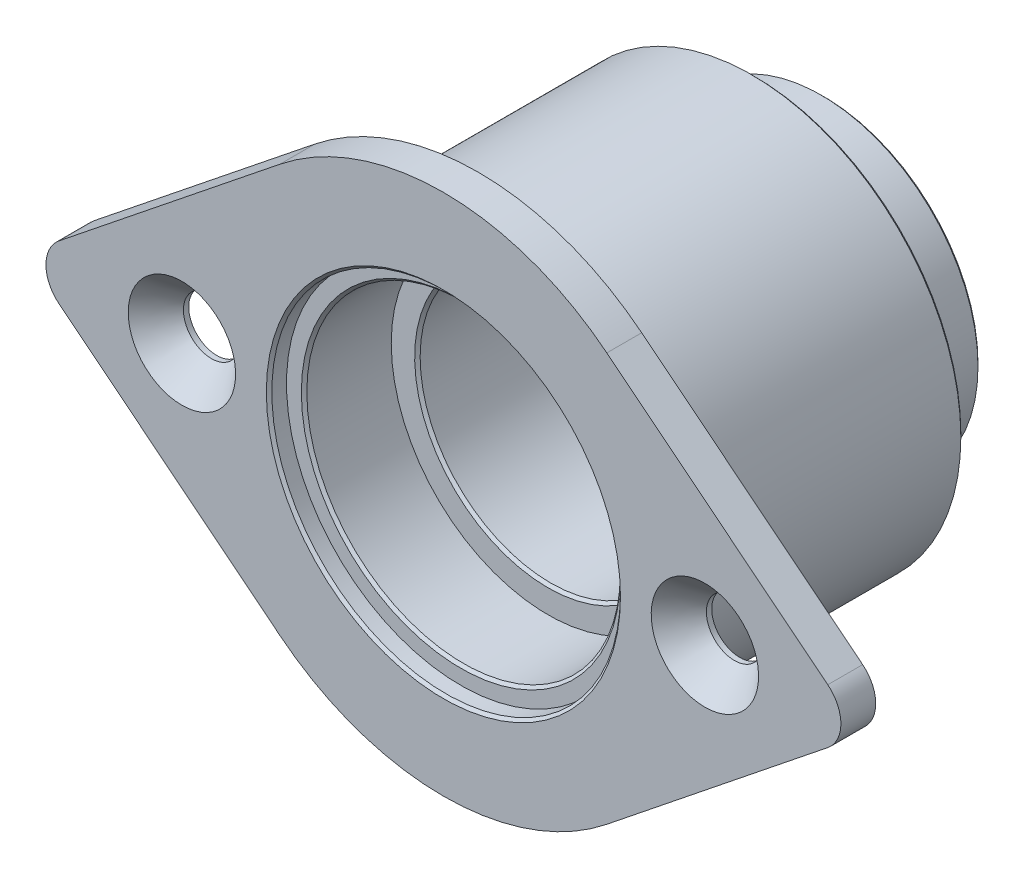
ISO-10303-21;
HEADER;
FILE_DESCRIPTION(('STEP AP214'),'2;1');
FILE_NAME('part.step','',(''),(''),'','','');
FILE_SCHEMA(('AUTOMOTIVE_DESIGN { 1 0 10303 214 1 1 1 1 }'));
ENDSEC;
DATA;
#1=APPLICATION_CONTEXT('core data for automotive mechanical design processes');
#2=APPLICATION_PROTOCOL_DEFINITION('international standard','automotive_design',2000,#1);
#3=PRODUCT_CONTEXT('',#1,'mechanical');
#4=PRODUCT('Part','Part','',(#3));
#5=PRODUCT_RELATED_PRODUCT_CATEGORY('part','',(#4));
#6=PRODUCT_DEFINITION_FORMATION('','',#4);
#7=PRODUCT_DEFINITION_CONTEXT('part definition',#1,'design');
#8=PRODUCT_DEFINITION('design','',#6,#7);
#9=PRODUCT_DEFINITION_SHAPE('','',#8);
#10=(LENGTH_UNIT() NAMED_UNIT(*) SI_UNIT(.MILLI.,.METRE.));
#11=(NAMED_UNIT(*) PLANE_ANGLE_UNIT() SI_UNIT($,.RADIAN.));
#12=(NAMED_UNIT(*) SI_UNIT($,.STERADIAN.) SOLID_ANGLE_UNIT());
#13=UNCERTAINTY_MEASURE_WITH_UNIT(LENGTH_MEASURE(1.E-05),#10,'distance_accuracy_value','');
#14=(GEOMETRIC_REPRESENTATION_CONTEXT(3) GLOBAL_UNCERTAINTY_ASSIGNED_CONTEXT((#13)) GLOBAL_UNIT_ASSIGNED_CONTEXT((#10,
#11,#12)) REPRESENTATION_CONTEXT('',''));
#15=CARTESIAN_POINT('',(0.,0.,0.));
#16=DIRECTION('',(0.,0.,1.));
#17=DIRECTION('',(1.,0.,0.));
#18=AXIS2_PLACEMENT_3D('',#15,#16,#17);
#19=CARTESIAN_POINT('',(0.,0.,-7.9375));
#20=DIRECTION('',(0.,0.,1.));
#21=DIRECTION('',(1.,0.,0.));
#22=AXIS2_PLACEMENT_3D('',#19,#20,#21);
#23=PLANE('',#22);
#24=CARTESIAN_POINT('',(0.,0.,-7.9375));
#25=DIRECTION('',(0.,0.,-1.));
#26=DIRECTION('',(-1.,0.,0.));
#27=AXIS2_PLACEMENT_3D('',#24,#25,#26);
#28=CIRCLE('',#27,14.2748);
#29=CARTESIAN_POINT('',(-14.2748,0.,-7.9375));
#30=VERTEX_POINT('',#29);
#31=EDGE_CURVE('E135',#30,#30,#28,.F.);
#32=ORIENTED_EDGE('',*,*,#31,.T.);
#33=EDGE_LOOP('',(#32));
#34=FACE_BOUND('',#33,.T.);
#35=CARTESIAN_POINT('',(0.,0.,-7.9375));
#36=DIRECTION('',(0.,0.,1.));
#37=DIRECTION('',(0.,-1.,0.));
#38=AXIS2_PLACEMENT_3D('',#35,#36,#37);
#39=CIRCLE('',#38,12.1435499999999);
#40=CARTESIAN_POINT('',(0.,-12.1435499999999,-7.9375));
#41=VERTEX_POINT('',#40);
#42=EDGE_CURVE('E19',#41,#41,#39,.F.);
#43=ORIENTED_EDGE('',*,*,#42,.T.);
#44=EDGE_LOOP('',(#43));
#45=FACE_BOUND('',#44,.T.);
#46=ADVANCED_FACE('F16',(#34,#45),#23,.T.);
#47=CARTESIAN_POINT('',(0.,0.,-7.9375));
#48=DIRECTION('',(0.,0.,1.));
#49=DIRECTION('',(0.,-1.,0.));
#50=AXIS2_PLACEMENT_3D('',#47,#48,#49);
#51=CONICAL_SURFACE('',#50,12.1435499999999,0.785398163397434);
#52=CARTESIAN_POINT('',(0.,0.,-8.18749999999995));
#53=DIRECTION('',(0.,0.,-1.));
#54=DIRECTION('',(-1.,0.,0.));
#55=AXIS2_PLACEMENT_3D('',#52,#53,#54);
#56=CIRCLE('',#55,11.89355);
#57=CARTESIAN_POINT('',(-11.89355,0.,-8.18749999999995));
#58=VERTEX_POINT('',#57);
#59=EDGE_CURVE('E133',#58,#58,#56,.T.);
#60=ORIENTED_EDGE('',*,*,#59,.T.);
#61=EDGE_LOOP('',(#60));
#62=FACE_BOUND('',#61,.T.);
#63=ORIENTED_EDGE('',*,*,#42,.F.);
#64=EDGE_LOOP('',(#63));
#65=FACE_BOUND('',#64,.T.);
#66=ADVANCED_FACE('F194',(#62,#65),#51,.F.);
#67=CARTESIAN_POINT('',(0.,0.,1.5875));
#68=DIRECTION('',(0.,0.,-1.));
#69=DIRECTION('',(-1.,0.,0.));
#70=AXIS2_PLACEMENT_3D('',#67,#68,#69);
#71=CYLINDRICAL_SURFACE('',#70,14.2748);
#72=CARTESIAN_POINT('',(0.,0.,-0.249999999999985));
#73=DIRECTION('',(0.,0.,1.));
#74=DIRECTION('',(1.,0.,0.));
#75=AXIS2_PLACEMENT_3D('',#72,#73,#74);
#76=CIRCLE('',#75,14.2748);
#77=CARTESIAN_POINT('',(14.2748,0.,-0.249999999999985));
#78=VERTEX_POINT('',#77);
#79=EDGE_CURVE('E130',#78,#78,#76,.T.);
#80=ORIENTED_EDGE('',*,*,#79,.T.);
#81=EDGE_LOOP('',(#80));
#82=FACE_BOUND('',#81,.T.);
#83=ORIENTED_EDGE('',*,*,#31,.F.);
#84=EDGE_LOOP('',(#83));
#85=FACE_BOUND('',#84,.T.);
#86=ADVANCED_FACE('F196',(#82,#85),#71,.F.);
#87=CARTESIAN_POINT('',(0.,0.,38.7877315203269));
#88=DIRECTION('',(0.,0.,-1.));
#89=DIRECTION('',(-1.,0.,0.));
#90=AXIS2_PLACEMENT_3D('',#87,#88,#89);
#91=CYLINDRICAL_SURFACE('',#90,11.89355);
#92=ORIENTED_EDGE('',*,*,#59,.F.);
#93=EDGE_LOOP('',(#92));
#94=FACE_BOUND('',#93,.T.);
#95=CARTESIAN_POINT('',(0.,0.,-32.8334999999999));
#96=DIRECTION('',(0.,0.,-1.));
#97=DIRECTION('',(-1.,0.,0.));
#98=AXIS2_PLACEMENT_3D('',#95,#96,#97);
#99=CIRCLE('',#98,11.89355);
#100=CARTESIAN_POINT('',(-11.89355,0.,-32.8334999999999));
#101=VERTEX_POINT('',#100);
#102=EDGE_CURVE('E126',#101,#101,#99,.T.);
#103=ORIENTED_EDGE('',*,*,#102,.T.);
#104=EDGE_LOOP('',(#103));
#105=FACE_BOUND('',#104,.T.);
#106=ADVANCED_FACE('F203',(#94,#105),#91,.F.);
#107=CARTESIAN_POINT('',(0.,0.,0.));
#108=DIRECTION('',(0.,0.,1.));
#109=DIRECTION('',(1.,0.,0.));
#110=AXIS2_PLACEMENT_3D('',#107,#108,#109);
#111=CONICAL_SURFACE('',#110,14.5248,0.785398163397459);
#112=ORIENTED_EDGE('',*,*,#79,.F.);
#113=EDGE_LOOP('',(#112));
#114=FACE_BOUND('',#113,.T.);
#115=CARTESIAN_POINT('',(0.,0.,0.));
#116=DIRECTION('',(0.,0.,1.));
#117=DIRECTION('',(1.,0.,0.));
#118=AXIS2_PLACEMENT_3D('',#115,#116,#117);
#119=CIRCLE('',#118,14.5248);
#120=CARTESIAN_POINT('',(14.5248,0.,0.));
#121=VERTEX_POINT('',#120);
#122=EDGE_CURVE('E129',#121,#121,#119,.F.);
#123=ORIENTED_EDGE('',*,*,#122,.F.);
#124=EDGE_LOOP('',(#123));
#125=FACE_BOUND('',#124,.T.);
#126=ADVANCED_FACE('F299',(#114,#125),#111,.F.);
#127=CARTESIAN_POINT('',(0.,0.,-33.0835));
#128=DIRECTION('',(0.,0.,-1.));
#129=DIRECTION('',(0.,1.,0.));
#130=AXIS2_PLACEMENT_3D('',#127,#128,#129);
#131=CONICAL_SURFACE('',#130,12.1435500000001,0.785398163397448);
#132=ORIENTED_EDGE('',*,*,#102,.F.);
#133=EDGE_LOOP('',(#132));
#134=FACE_BOUND('',#133,.T.);
#135=CARTESIAN_POINT('',(0.,0.,-33.0835));
#136=DIRECTION('',(0.,0.,-1.));
#137=DIRECTION('',(0.,1.,0.));
#138=AXIS2_PLACEMENT_3D('',#135,#136,#137);
#139=CIRCLE('',#138,12.1435500000001);
#140=CARTESIAN_POINT('',(0.,12.1435500000001,-33.0835));
#141=VERTEX_POINT('',#140);
#142=EDGE_CURVE('E183',#141,#141,#139,.F.);
#143=ORIENTED_EDGE('',*,*,#142,.F.);
#144=EDGE_LOOP('',(#143));
#145=FACE_BOUND('',#144,.T.);
#146=ADVANCED_FACE('F295',(#134,#145),#131,.F.);
#147=CARTESIAN_POINT('',(0.,0.,0.));
#148=DIRECTION('',(0.,0.,1.));
#149=DIRECTION('',(1.,0.,0.));
#150=AXIS2_PLACEMENT_3D('',#147,#148,#149);
#151=PLANE('',#150);
#152=CARTESIAN_POINT('',(0.,0.,0.));
#153=DIRECTION('',(0.,0.,1.));
#154=DIRECTION('',(1.,0.,0.));
#155=AXIS2_PLACEMENT_3D('',#152,#153,#154);
#156=CIRCLE('',#155,15.875);
#157=CARTESIAN_POINT('',(15.875,0.,0.));
#158=VERTEX_POINT('',#157);
#159=EDGE_CURVE('E180',#158,#158,#156,.T.);
#160=ORIENTED_EDGE('',*,*,#159,.T.);
#161=EDGE_LOOP('',(#160));
#162=FACE_BOUND('',#161,.T.);
#163=ORIENTED_EDGE('',*,*,#122,.T.);
#164=EDGE_LOOP('',(#163));
#165=FACE_BOUND('',#164,.T.);
#166=ADVANCED_FACE('F291',(#162,#165),#151,.T.);
#167=CARTESIAN_POINT('',(0.,0.,-33.0835));
#168=DIRECTION('',(0.,0.,-1.));
#169=DIRECTION('',(-1.,0.,0.));
#170=AXIS2_PLACEMENT_3D('',#167,#168,#169);
#171=PLANE('',#170);
#172=ORIENTED_EDGE('',*,*,#142,.T.);
#173=EDGE_LOOP('',(#172));
#174=FACE_BOUND('',#173,.T.);
#175=CARTESIAN_POINT('',(0.,0.,-33.0835));
#176=DIRECTION('',(0.,0.,1.));
#177=DIRECTION('',(1.,0.,0.));
#178=AXIS2_PLACEMENT_3D('',#175,#176,#177);
#179=CIRCLE('',#178,14.0121);
#180=CARTESIAN_POINT('',(14.0121,0.,-33.0835));
#181=VERTEX_POINT('',#180);
#182=EDGE_CURVE('E125',#181,#181,#179,.T.);
#183=ORIENTED_EDGE('',*,*,#182,.F.);
#184=EDGE_LOOP('',(#183));
#185=FACE_BOUND('',#184,.T.);
#186=ADVANCED_FACE('F287',(#174,#185),#171,.T.);
#187=CARTESIAN_POINT('',(0.,0.,0.));
#188=DIRECTION('',(0.,0.,1.));
#189=DIRECTION('',(1.,0.,0.));
#190=AXIS2_PLACEMENT_3D('',#187,#188,#189);
#191=CYLINDRICAL_SURFACE('',#190,15.875);
#192=ORIENTED_EDGE('',*,*,#159,.F.);
#193=EDGE_LOOP('',(#192));
#194=FACE_BOUND('',#193,.T.);
#195=CARTESIAN_POINT('',(0.,0.,1.3375));
#196=DIRECTION('',(0.,0.,1.));
#197=DIRECTION('',(1.,0.,0.));
#198=AXIS2_PLACEMENT_3D('',#195,#196,#197);
#199=CIRCLE('',#198,15.875);
#200=CARTESIAN_POINT('',(15.875,0.,1.3375));
#201=VERTEX_POINT('',#200);
#202=EDGE_CURVE('E122',#201,#201,#199,.T.);
#203=ORIENTED_EDGE('',*,*,#202,.T.);
#204=EDGE_LOOP('',(#203));
#205=FACE_BOUND('',#204,.T.);
#206=ADVANCED_FACE('F283',(#194,#205),#191,.F.);
#207=CARTESIAN_POINT('',(0.,0.,-32.8335));
#208=DIRECTION('',(0.,0.,1.));
#209=DIRECTION('',(1.,0.,0.));
#210=AXIS2_PLACEMENT_3D('',#207,#208,#209);
#211=CONICAL_SURFACE('',#210,14.2621,0.785398163397424);
#212=CARTESIAN_POINT('',(0.,0.,-32.8335));
#213=DIRECTION('',(0.,0.,-1.));
#214=DIRECTION('',(-1.,0.,0.));
#215=AXIS2_PLACEMENT_3D('',#212,#213,#214);
#216=CIRCLE('',#215,14.2621);
#217=CARTESIAN_POINT('',(-14.2621,0.,-32.8335));
#218=VERTEX_POINT('',#217);
#219=EDGE_CURVE('E118',#218,#218,#216,.F.);
#220=ORIENTED_EDGE('',*,*,#219,.F.);
#221=EDGE_LOOP('',(#220));
#222=FACE_BOUND('',#221,.T.);
#223=ORIENTED_EDGE('',*,*,#182,.T.);
#224=EDGE_LOOP('',(#223));
#225=FACE_BOUND('',#224,.T.);
#226=ADVANCED_FACE('F279',(#222,#225),#211,.T.);
#227=CARTESIAN_POINT('',(0.,0.,1.5875));
#228=DIRECTION('',(0.,0.,1.));
#229=DIRECTION('',(1.,0.,0.));
#230=AXIS2_PLACEMENT_3D('',#227,#228,#229);
#231=CONICAL_SURFACE('',#230,16.125,0.785398163397476);
#232=ORIENTED_EDGE('',*,*,#202,.F.);
#233=EDGE_LOOP('',(#232));
#234=FACE_BOUND('',#233,.T.);
#235=CARTESIAN_POINT('',(0.,0.,1.5875));
#236=DIRECTION('',(0.,0.,1.));
#237=DIRECTION('',(1.,0.,0.));
#238=AXIS2_PLACEMENT_3D('',#235,#236,#237);
#239=CIRCLE('',#238,16.125);
#240=CARTESIAN_POINT('',(16.125,0.,1.5875));
#241=VERTEX_POINT('',#240);
#242=EDGE_CURVE('E121',#241,#241,#239,.F.);
#243=ORIENTED_EDGE('',*,*,#242,.F.);
#244=EDGE_LOOP('',(#243));
#245=FACE_BOUND('',#244,.T.);
#246=ADVANCED_FACE('F275',(#234,#245),#231,.F.);
#247=CARTESIAN_POINT('',(0.,0.,27.1480367264149));
#248=DIRECTION('',(0.,0.,-1.));
#249=DIRECTION('',(-1.,0.,0.));
#250=AXIS2_PLACEMENT_3D('',#247,#248,#249);
#251=CYLINDRICAL_SURFACE('',#250,14.2621);
#252=ORIENTED_EDGE('',*,*,#219,.T.);
#253=EDGE_LOOP('',(#252));
#254=FACE_BOUND('',#253,.T.);
#255=CARTESIAN_POINT('',(0.,0.,-26.7335));
#256=DIRECTION('',(0.,0.,-1.));
#257=DIRECTION('',(-1.,0.,0.));
#258=AXIS2_PLACEMENT_3D('',#255,#256,#257);
#259=CIRCLE('',#258,14.2621);
#260=CARTESIAN_POINT('',(-14.2621,0.,-26.7335));
#261=VERTEX_POINT('',#260);
#262=EDGE_CURVE('E117',#261,#261,#259,.F.);
#263=ORIENTED_EDGE('',*,*,#262,.F.);
#264=EDGE_LOOP('',(#263));
#265=FACE_BOUND('',#264,.T.);
#266=ADVANCED_FACE('F271',(#254,#265),#251,.T.);
#267=CARTESIAN_POINT('',(-23.8125,0.,1.58749999997099));
#268=DIRECTION('',(0.,0.,1.));
#269=DIRECTION('',(0.,-1.,0.));
#270=AXIS2_PLACEMENT_3D('',#267,#268,#269);
#271=CONICAL_SURFACE('',#270,4.88949999997067,0.71558499333661);
#272=CARTESIAN_POINT('',(-23.8125,0.,-1.10068089399406));
#273=DIRECTION('',(0.,0.,1.));
#274=DIRECTION('',(1.,0.,0.));
#275=AXIS2_PLACEMENT_3D('',#272,#273,#274);
#276=CIRCLE('',#275,2.5527);
#277=CARTESIAN_POINT('',(-21.2598,0.,-1.10068089399406));
#278=VERTEX_POINT('',#277);
#279=EDGE_CURVE('E114',#278,#278,#276,.F.);
#280=ORIENTED_EDGE('',*,*,#279,.T.);
#281=EDGE_LOOP('',(#280));
#282=FACE_BOUND('',#281,.T.);
#283=CARTESIAN_POINT('',(-23.8125,0.,1.58749999997099));
#284=DIRECTION('',(0.,0.,1.));
#285=DIRECTION('',(0.,-1.,0.));
#286=AXIS2_PLACEMENT_3D('',#283,#284,#285);
#287=CIRCLE('',#286,4.88949999997067);
#288=CARTESIAN_POINT('',(-23.8125,-4.88949999997067,1.58749999997099));
#289=VERTEX_POINT('',#288);
#290=EDGE_CURVE('E173',#289,#289,#287,.F.);
#291=ORIENTED_EDGE('',*,*,#290,.F.);
#292=EDGE_LOOP('',(#291));
#293=FACE_BOUND('',#292,.T.);
#294=ADVANCED_FACE('F267',(#282,#293),#271,.F.);
#295=CARTESIAN_POINT('',(23.8125,0.,1.58749999997099));
#296=DIRECTION('',(0.,0.,1.));
#297=DIRECTION('',(0.,-1.,0.));
#298=AXIS2_PLACEMENT_3D('',#295,#296,#297);
#299=CONICAL_SURFACE('',#298,4.88949999995293,0.71558499333661);
#300=CARTESIAN_POINT('',(23.8125,0.,-1.10068089399406));
#301=DIRECTION('',(0.,0.,1.));
#302=DIRECTION('',(1.,0.,0.));
#303=AXIS2_PLACEMENT_3D('',#300,#301,#302);
#304=CIRCLE('',#303,2.5527);
#305=CARTESIAN_POINT('',(26.3652,0.,-1.10068089399406));
#306=VERTEX_POINT('',#305);
#307=EDGE_CURVE('E92',#306,#306,#304,.F.);
#308=ORIENTED_EDGE('',*,*,#307,.T.);
#309=EDGE_LOOP('',(#308));
#310=FACE_BOUND('',#309,.T.);
#311=CARTESIAN_POINT('',(23.8125,0.,1.58749999997099));
#312=DIRECTION('',(0.,0.,1.));
#313=DIRECTION('',(0.,-1.,0.));
#314=AXIS2_PLACEMENT_3D('',#311,#312,#313);
#315=CIRCLE('',#314,4.88949999995293);
#316=CARTESIAN_POINT('',(23.8125,-4.88949999995292,1.58749999997099));
#317=VERTEX_POINT('',#316);
#318=EDGE_CURVE('E170',#317,#317,#315,.F.);
#319=ORIENTED_EDGE('',*,*,#318,.F.);
#320=EDGE_LOOP('',(#319));
#321=FACE_BOUND('',#320,.T.);
#322=ADVANCED_FACE('F264',(#310,#321),#299,.F.);
#323=CARTESIAN_POINT('',(0.,0.,1.5875));
#324=DIRECTION('',(0.,0.,1.));
#325=DIRECTION('',(1.,0.,0.));
#326=AXIS2_PLACEMENT_3D('',#323,#324,#325);
#327=PLANE('',#326);
#328=DIRECTION('',(-0.7806247497998,0.625,0.));
#329=VECTOR('',#328,1.);
#330=CARTESIAN_POINT('',(-14.8828125,-18.5886268546077,1.5875));
#331=LINE('',#330,#329);
#332=CARTESIAN_POINT('',(-35.004375,-2.47848358061436,1.5875));
#333=VERTEX_POINT('',#332);
#334=CARTESIAN_POINT('',(-14.8828125,-18.5886268546077,1.5875));
#335=VERTEX_POINT('',#334);
#336=EDGE_CURVE('E110',#333,#335,#331,.F.);
#337=ORIENTED_EDGE('',*,*,#336,.T.);
#338=CARTESIAN_POINT('',(0.,0.,1.5875));
#339=DIRECTION('',(0.,0.,-1.));
#340=DIRECTION('',(-1.,0.,0.));
#341=AXIS2_PLACEMENT_3D('',#338,#339,#340);
#342=CIRCLE('',#341,23.8125);
#343=CARTESIAN_POINT('',(14.8828125,-18.5886268546077,1.5875));
#344=VERTEX_POINT('',#343);
#345=EDGE_CURVE('E162',#344,#335,#342,.T.);
#346=ORIENTED_EDGE('',*,*,#345,.F.);
#347=DIRECTION('',(0.7806247497998,0.625,0.));
#348=VECTOR('',#347,1.);
#349=CARTESIAN_POINT('',(14.8828125,-18.5886268546077,1.5875));
#350=LINE('',#349,#348);
#351=CARTESIAN_POINT('',(35.004375,-2.47848358061437,1.5875));
#352=VERTEX_POINT('',#351);
#353=EDGE_CURVE('E552',#352,#344,#350,.F.);
#354=ORIENTED_EDGE('',*,*,#353,.F.);
#355=CARTESIAN_POINT('',(33.02,0.,1.5875));
#356=DIRECTION('',(0.,0.,-1.));
#357=DIRECTION('',(-1.,0.,0.));
#358=AXIS2_PLACEMENT_3D('',#355,#356,#357);
#359=CIRCLE('',#358,3.175);
#360=CARTESIAN_POINT('',(35.004375,2.47848358061436,1.5875));
#361=VERTEX_POINT('',#360);
#362=EDGE_CURVE('E157',#361,#352,#359,.T.);
#363=ORIENTED_EDGE('',*,*,#362,.F.);
#364=DIRECTION('',(-0.7806247497998,0.625,0.));
#365=VECTOR('',#364,1.);
#366=CARTESIAN_POINT('',(14.8828125,18.5886268546077,1.5875));
#367=LINE('',#366,#365);
#368=CARTESIAN_POINT('',(14.8828125,18.5886268546077,1.5875));
#369=VERTEX_POINT('',#368);
#370=EDGE_CURVE('E88',#369,#361,#367,.F.);
#371=ORIENTED_EDGE('',*,*,#370,.F.);
#372=CARTESIAN_POINT('',(0.,0.,1.5875));
#373=DIRECTION('',(0.,0.,-1.));
#374=DIRECTION('',(-1.,0.,0.));
#375=AXIS2_PLACEMENT_3D('',#372,#373,#374);
#376=CIRCLE('',#375,23.8125);
#377=CARTESIAN_POINT('',(-14.8828125,18.5886268546077,1.5875));
#378=VERTEX_POINT('',#377);
#379=EDGE_CURVE('E80',#378,#369,#376,.T.);
#380=ORIENTED_EDGE('',*,*,#379,.F.);
#381=DIRECTION('',(0.7806247497998,0.625,0.));
#382=VECTOR('',#381,1.);
#383=CARTESIAN_POINT('',(-14.8828125,18.5886268546077,1.5875));
#384=LINE('',#383,#382);
#385=CARTESIAN_POINT('',(-35.004375,2.47848358061436,1.5875));
#386=VERTEX_POINT('',#385);
#387=EDGE_CURVE('E85',#378,#386,#384,.F.);
#388=ORIENTED_EDGE('',*,*,#387,.T.);
#389=CARTESIAN_POINT('',(-33.02,0.,1.5875));
#390=DIRECTION('',(0.,0.,-1.));
#391=DIRECTION('',(-1.,0.,0.));
#392=AXIS2_PLACEMENT_3D('',#389,#390,#391);
#393=CIRCLE('',#392,3.175);
#394=EDGE_CURVE('E106',#333,#386,#393,.T.);
#395=ORIENTED_EDGE('',*,*,#394,.F.);
#396=EDGE_LOOP('',(#337,#346,#354,#363,#371,#380,#388,#395));
#397=FACE_BOUND('',#396,.T.);
#398=ORIENTED_EDGE('',*,*,#318,.T.);
#399=EDGE_LOOP('',(#398));
#400=FACE_BOUND('',#399,.T.);
#401=ORIENTED_EDGE('',*,*,#290,.T.);
#402=EDGE_LOOP('',(#401));
#403=FACE_BOUND('',#402,.T.);
#404=ORIENTED_EDGE('',*,*,#242,.T.);
#405=EDGE_LOOP('',(#404));
#406=FACE_BOUND('',#405,.T.);
#407=ADVANCED_FACE('F82',(#397,#400,#403,#406),#327,.T.);
#408=CARTESIAN_POINT('',(0.,0.,-26.7335));
#409=DIRECTION('',(0.,0.,-1.));
#410=DIRECTION('',(-1.,0.,0.));
#411=AXIS2_PLACEMENT_3D('',#408,#409,#410);
#412=PLANE('',#411);
#413=ORIENTED_EDGE('',*,*,#262,.T.);
#414=EDGE_LOOP('',(#413));
#415=FACE_BOUND('',#414,.T.);
#416=CARTESIAN_POINT('',(0.,0.,-26.7335));
#417=DIRECTION('',(0.,0.,1.));
#418=DIRECTION('',(1.,0.,0.));
#419=AXIS2_PLACEMENT_3D('',#416,#417,#418);
#420=CIRCLE('',#419,18.8);
#421=CARTESIAN_POINT('',(18.8,0.,-26.7335));
#422=VERTEX_POINT('',#421);
#423=EDGE_CURVE('E153',#422,#422,#420,.T.);
#424=ORIENTED_EDGE('',*,*,#423,.F.);
#425=EDGE_LOOP('',(#424));
#426=FACE_BOUND('',#425,.T.);
#427=ADVANCED_FACE('F257',(#415,#426),#412,.T.);
#428=CARTESIAN_POINT('',(-23.8125,0.,1.5875));
#429=DIRECTION('',(0.,0.,1.));
#430=DIRECTION('',(1.,0.,0.));
#431=AXIS2_PLACEMENT_3D('',#428,#429,#430);
#432=CYLINDRICAL_SURFACE('',#431,2.5527);
#433=CARTESIAN_POINT('',(-23.8125,0.,-1.5875));
#434=DIRECTION('',(0.,0.,1.));
#435=DIRECTION('',(1.,0.,0.));
#436=AXIS2_PLACEMENT_3D('',#433,#434,#435);
#437=CIRCLE('',#436,2.5527);
#438=CARTESIAN_POINT('',(-21.2598,0.,-1.5875));
#439=VERTEX_POINT('',#438);
#440=EDGE_CURVE('E150',#439,#439,#437,.F.);
#441=ORIENTED_EDGE('',*,*,#440,.T.);
#442=EDGE_LOOP('',(#441));
#443=FACE_BOUND('',#442,.T.);
#444=ORIENTED_EDGE('',*,*,#279,.F.);
#445=EDGE_LOOP('',(#444));
#446=FACE_BOUND('',#445,.T.);
#447=ADVANCED_FACE('F253',(#443,#446),#432,.F.);
#448=CARTESIAN_POINT('',(23.8125,0.,1.5875));
#449=DIRECTION('',(0.,0.,1.));
#450=DIRECTION('',(1.,0.,0.));
#451=AXIS2_PLACEMENT_3D('',#448,#449,#450);
#452=CYLINDRICAL_SURFACE('',#451,2.5527);
#453=CARTESIAN_POINT('',(23.8125,0.,-1.5875));
#454=DIRECTION('',(0.,0.,1.));
#455=DIRECTION('',(1.,0.,0.));
#456=AXIS2_PLACEMENT_3D('',#453,#454,#455);
#457=CIRCLE('',#456,2.5527);
#458=CARTESIAN_POINT('',(26.3652,0.,-1.5875));
#459=VERTEX_POINT('',#458);
#460=EDGE_CURVE('E147',#459,#459,#457,.F.);
#461=ORIENTED_EDGE('',*,*,#460,.T.);
#462=EDGE_LOOP('',(#461));
#463=FACE_BOUND('',#462,.T.);
#464=ORIENTED_EDGE('',*,*,#307,.F.);
#465=EDGE_LOOP('',(#464));
#466=FACE_BOUND('',#465,.T.);
#467=ADVANCED_FACE('F250',(#463,#466),#452,.F.);
#468=CARTESIAN_POINT('',(0.,0.,1.5875));
#469=DIRECTION('',(0.,0.,-1.));
#470=DIRECTION('',(-1.,0.,0.));
#471=AXIS2_PLACEMENT_3D('',#468,#469,#470);
#472=CYLINDRICAL_SURFACE('',#471,23.8125);
#473=ORIENTED_EDGE('',*,*,#379,.T.);
#474=DIRECTION('',(0.,0.,1.));
#475=VECTOR('',#474,1.);
#476=CARTESIAN_POINT('',(14.8828125,18.5886268546077,1.5875));
#477=LINE('',#476,#475);
#478=CARTESIAN_POINT('',(14.8828125,18.5886268546077,-1.5875));
#479=VERTEX_POINT('',#478);
#480=EDGE_CURVE('E156',#479,#369,#477,.T.);
#481=ORIENTED_EDGE('',*,*,#480,.F.);
#482=CARTESIAN_POINT('',(0.,0.,-1.5875));
#483=DIRECTION('',(0.,0.,-1.));
#484=DIRECTION('',(-1.,0.,0.));
#485=AXIS2_PLACEMENT_3D('',#482,#483,#484);
#486=CIRCLE('',#485,23.8125);
#487=CARTESIAN_POINT('',(-14.8828125,18.5886268546077,-1.5875));
#488=VERTEX_POINT('',#487);
#489=EDGE_CURVE('E97',#479,#488,#486,.F.);
#490=ORIENTED_EDGE('',*,*,#489,.T.);
#491=DIRECTION('',(0.,0.,1.));
#492=VECTOR('',#491,1.);
#493=CARTESIAN_POINT('',(-14.8828125,18.5886268546077,1.5875));
#494=LINE('',#493,#492);
#495=EDGE_CURVE('E91',#488,#378,#494,.T.);
#496=ORIENTED_EDGE('',*,*,#495,.T.);
#497=EDGE_LOOP('',(#473,#481,#490,#496));
#498=FACE_BOUND('',#497,.T.);
#499=ADVANCED_FACE('F95',(#498),#472,.T.);
#500=CARTESIAN_POINT('',(-14.8828125,18.5886268546077,1.5875));
#501=DIRECTION('',(0.625,-0.7806247497998,0.));
#502=DIRECTION('',(0.7806247497998,0.625,0.));
#503=AXIS2_PLACEMENT_3D('',#500,#501,#502);
#504=PLANE('',#503);
#505=DIRECTION('',(0.,0.,-1.));
#506=VECTOR('',#505,1.);
#507=CARTESIAN_POINT('',(-35.004375,2.47848358061435,1.5875));
#508=LINE('',#507,#506);
#509=CARTESIAN_POINT('',(-35.004375,2.47848358061436,-1.5875));
#510=VERTEX_POINT('',#509);
#511=EDGE_CURVE('E104',#386,#510,#508,.T.);
#512=ORIENTED_EDGE('',*,*,#511,.F.);
#513=ORIENTED_EDGE('',*,*,#387,.F.);
#514=ORIENTED_EDGE('',*,*,#495,.F.);
#515=DIRECTION('',(-0.7806247497998,-0.625,0.));
#516=VECTOR('',#515,1.);
#517=CARTESIAN_POINT('',(-14.8828125,18.5886268546077,-1.5875));
#518=LINE('',#517,#516);
#519=EDGE_CURVE('E145',#488,#510,#518,.T.);
#520=ORIENTED_EDGE('',*,*,#519,.T.);
#521=EDGE_LOOP('',(#512,#513,#514,#520));
#522=FACE_BOUND('',#521,.T.);
#523=ADVANCED_FACE('F102',(#522),#504,.F.);
#524=CARTESIAN_POINT('',(-33.02,0.,1.5875));
#525=DIRECTION('',(0.,0.,-1.));
#526=DIRECTION('',(-1.,0.,0.));
#527=AXIS2_PLACEMENT_3D('',#524,#525,#526);
#528=CYLINDRICAL_SURFACE('',#527,3.175);
#529=CARTESIAN_POINT('',(-33.02,0.,-1.5875));
#530=DIRECTION('',(0.,0.,-1.));
#531=DIRECTION('',(-1.,0.,0.));
#532=AXIS2_PLACEMENT_3D('',#529,#530,#531);
#533=CIRCLE('',#532,3.175);
#534=CARTESIAN_POINT('',(-35.004375,-2.47848358061437,-1.5875));
#535=VERTEX_POINT('',#534);
#536=EDGE_CURVE('E143',#510,#535,#533,.F.);
#537=ORIENTED_EDGE('',*,*,#536,.T.);
#538=DIRECTION('',(0.,0.,1.));
#539=VECTOR('',#538,1.);
#540=CARTESIAN_POINT('',(-35.004375,-2.47848358061437,1.5875));
#541=LINE('',#540,#539);
#542=EDGE_CURVE('E166',#535,#333,#541,.T.);
#543=ORIENTED_EDGE('',*,*,#542,.T.);
#544=ORIENTED_EDGE('',*,*,#394,.T.);
#545=ORIENTED_EDGE('',*,*,#511,.T.);
#546=EDGE_LOOP('',(#537,#543,#544,#545));
#547=FACE_BOUND('',#546,.T.);
#548=ADVANCED_FACE('F241',(#547),#528,.T.);
#549=CARTESIAN_POINT('',(-14.8828125,-18.5886268546077,1.5875));
#550=DIRECTION('',(0.625,0.7806247497998,0.));
#551=DIRECTION('',(-0.7806247497998,0.625,0.));
#552=AXIS2_PLACEMENT_3D('',#549,#550,#551);
#553=PLANE('',#552);
#554=ORIENTED_EDGE('',*,*,#542,.F.);
#555=DIRECTION('',(0.7806247497998,-0.625,0.));
#556=VECTOR('',#555,1.);
#557=CARTESIAN_POINT('',(-35.004375,-2.47848358061437,-1.5875));
#558=LINE('',#557,#556);
#559=CARTESIAN_POINT('',(-14.8828125,-18.5886268546077,-1.5875));
#560=VERTEX_POINT('',#559);
#561=EDGE_CURVE('E142',#535,#560,#558,.T.);
#562=ORIENTED_EDGE('',*,*,#561,.T.);
#563=DIRECTION('',(0.,0.,-1.));
#564=VECTOR('',#563,1.);
#565=CARTESIAN_POINT('',(-14.8828125,-18.5886268546077,1.5875));
#566=LINE('',#565,#564);
#567=EDGE_CURVE('E165',#335,#560,#566,.T.);
#568=ORIENTED_EDGE('',*,*,#567,.F.);
#569=ORIENTED_EDGE('',*,*,#336,.F.);
#570=EDGE_LOOP('',(#554,#562,#568,#569));
#571=FACE_BOUND('',#570,.T.);
#572=ADVANCED_FACE('F237',(#571),#553,.F.);
#573=CARTESIAN_POINT('',(0.,0.,1.5875));
#574=DIRECTION('',(0.,0.,-1.));
#575=DIRECTION('',(-1.,0.,0.));
#576=AXIS2_PLACEMENT_3D('',#573,#574,#575);
#577=CYLINDRICAL_SURFACE('',#576,23.8125);
#578=ORIENTED_EDGE('',*,*,#345,.T.);
#579=ORIENTED_EDGE('',*,*,#567,.T.);
#580=CARTESIAN_POINT('',(0.,0.,-1.5875));
#581=DIRECTION('',(0.,0.,-1.));
#582=DIRECTION('',(-1.,0.,0.));
#583=AXIS2_PLACEMENT_3D('',#580,#581,#582);
#584=CIRCLE('',#583,23.8125);
#585=CARTESIAN_POINT('',(14.8828125,-18.5886268546077,-1.5875));
#586=VERTEX_POINT('',#585);
#587=EDGE_CURVE('E140',#560,#586,#584,.F.);
#588=ORIENTED_EDGE('',*,*,#587,.T.);
#589=DIRECTION('',(0.,0.,1.));
#590=VECTOR('',#589,1.);
#591=CARTESIAN_POINT('',(14.8828125,-18.5886268546077,1.5875));
#592=LINE('',#591,#590);
#593=EDGE_CURVE('E161',#344,#586,#592,.F.);
#594=ORIENTED_EDGE('',*,*,#593,.F.);
#595=EDGE_LOOP('',(#578,#579,#588,#594));
#596=FACE_BOUND('',#595,.T.);
#597=ADVANCED_FACE('F233',(#596),#577,.T.);
#598=CARTESIAN_POINT('',(14.8828125,-18.5886268546077,1.5875));
#599=DIRECTION('',(0.625,-0.7806247497998,0.));
#600=DIRECTION('',(0.7806247497998,0.625,0.));
#601=AXIS2_PLACEMENT_3D('',#598,#599,#600);
#602=PLANE('',#601);
#603=ORIENTED_EDGE('',*,*,#353,.T.);
#604=ORIENTED_EDGE('',*,*,#593,.T.);
#605=DIRECTION('',(0.7806247497998,0.625,0.));
#606=VECTOR('',#605,1.);
#607=CARTESIAN_POINT('',(14.8828125,-18.5886268546077,-1.5875));
#608=LINE('',#607,#606);
#609=CARTESIAN_POINT('',(35.004375,-2.47848358061437,-1.5875));
#610=VERTEX_POINT('',#609);
#611=EDGE_CURVE('E139',#586,#610,#608,.T.);
#612=ORIENTED_EDGE('',*,*,#611,.T.);
#613=DIRECTION('',(0.,0.,-1.));
#614=VECTOR('',#613,1.);
#615=CARTESIAN_POINT('',(35.004375,-2.47848358061437,1.5875));
#616=LINE('',#615,#614);
#617=EDGE_CURVE('E160',#352,#610,#616,.T.);
#618=ORIENTED_EDGE('',*,*,#617,.F.);
#619=EDGE_LOOP('',(#603,#604,#612,#618));
#620=FACE_BOUND('',#619,.T.);
#621=ADVANCED_FACE('F230',(#620),#602,.T.);
#622=CARTESIAN_POINT('',(33.02,0.,1.5875));
#623=DIRECTION('',(0.,0.,-1.));
#624=DIRECTION('',(-1.,0.,0.));
#625=AXIS2_PLACEMENT_3D('',#622,#623,#624);
#626=CYLINDRICAL_SURFACE('',#625,3.175);
#627=CARTESIAN_POINT('',(33.02,0.,-1.5875));
#628=DIRECTION('',(0.,0.,-1.));
#629=DIRECTION('',(-1.,0.,0.));
#630=AXIS2_PLACEMENT_3D('',#627,#628,#629);
#631=CIRCLE('',#630,3.175);
#632=CARTESIAN_POINT('',(35.004375,2.47848358061436,-1.5875));
#633=VERTEX_POINT('',#632);
#634=EDGE_CURVE('E34',#610,#633,#631,.F.);
#635=ORIENTED_EDGE('',*,*,#634,.T.);
#636=DIRECTION('',(0.,0.,1.));
#637=VECTOR('',#636,1.);
#638=CARTESIAN_POINT('',(35.004375,2.47848358061436,1.5875));
#639=LINE('',#638,#637);
#640=EDGE_CURVE('E546',#361,#633,#639,.F.);
#641=ORIENTED_EDGE('',*,*,#640,.F.);
#642=ORIENTED_EDGE('',*,*,#362,.T.);
#643=ORIENTED_EDGE('',*,*,#617,.T.);
#644=EDGE_LOOP('',(#635,#641,#642,#643));
#645=FACE_BOUND('',#644,.T.);
#646=ADVANCED_FACE('F226',(#645),#626,.T.);
#647=CARTESIAN_POINT('',(14.8828125,18.5886268546077,1.5875));
#648=DIRECTION('',(0.625,0.7806247497998,0.));
#649=DIRECTION('',(-0.7806247497998,0.625,0.));
#650=AXIS2_PLACEMENT_3D('',#647,#648,#649);
#651=PLANE('',#650);
#652=DIRECTION('',(-0.7806247497998,0.625,0.));
#653=VECTOR('',#652,1.);
#654=CARTESIAN_POINT('',(35.004375,2.47848358061437,-1.5875));
#655=LINE('',#654,#653);
#656=EDGE_CURVE('E138',#633,#479,#655,.T.);
#657=ORIENTED_EDGE('',*,*,#656,.T.);
#658=ORIENTED_EDGE('',*,*,#480,.T.);
#659=ORIENTED_EDGE('',*,*,#370,.T.);
#660=ORIENTED_EDGE('',*,*,#640,.T.);
#661=EDGE_LOOP('',(#657,#658,#659,#660));
#662=FACE_BOUND('',#661,.T.);
#663=ADVANCED_FACE('F222',(#662),#651,.T.);
#664=CARTESIAN_POINT('',(0.,0.,-26.4835));
#665=DIRECTION('',(0.,0.,1.));
#666=DIRECTION('',(1.,0.,0.));
#667=AXIS2_PLACEMENT_3D('',#664,#665,#666);
#668=CONICAL_SURFACE('',#667,19.05,0.785398163397434);
#669=ORIENTED_EDGE('',*,*,#423,.T.);
#670=EDGE_LOOP('',(#669));
#671=FACE_BOUND('',#670,.T.);
#672=CARTESIAN_POINT('',(0.,0.,-26.4835));
#673=DIRECTION('',(0.,0.,1.));
#674=DIRECTION('',(1.,0.,0.));
#675=AXIS2_PLACEMENT_3D('',#672,#673,#674);
#676=CIRCLE('',#675,19.05);
#677=CARTESIAN_POINT('',(19.05,0.,-26.4835));
#678=VERTEX_POINT('',#677);
#679=EDGE_CURVE('E25',#678,#678,#676,.T.);
#680=ORIENTED_EDGE('',*,*,#679,.F.);
#681=EDGE_LOOP('',(#680));
#682=FACE_BOUND('',#681,.T.);
#683=ADVANCED_FACE('F214',(#671,#682),#668,.T.);
#684=CARTESIAN_POINT('',(0.,0.,-1.5875));
#685=DIRECTION('',(0.,0.,1.));
#686=DIRECTION('',(1.,0.,0.));
#687=AXIS2_PLACEMENT_3D('',#684,#685,#686);
#688=PLANE('',#687);
#689=CARTESIAN_POINT('',(0.,0.,-1.5875));
#690=DIRECTION('',(0.,0.,1.));
#691=DIRECTION('',(1.,0.,0.));
#692=AXIS2_PLACEMENT_3D('',#689,#690,#691);
#693=CIRCLE('',#692,19.05);
#694=CARTESIAN_POINT('',(19.05,0.,-1.5875));
#695=VERTEX_POINT('',#694);
#696=EDGE_CURVE('E11',#695,#695,#693,.F.);
#697=ORIENTED_EDGE('',*,*,#696,.F.);
#698=EDGE_LOOP('',(#697));
#699=FACE_BOUND('',#698,.T.);
#700=ORIENTED_EDGE('',*,*,#634,.F.);
#701=ORIENTED_EDGE('',*,*,#611,.F.);
#702=ORIENTED_EDGE('',*,*,#587,.F.);
#703=ORIENTED_EDGE('',*,*,#561,.F.);
#704=ORIENTED_EDGE('',*,*,#536,.F.);
#705=ORIENTED_EDGE('',*,*,#519,.F.);
#706=ORIENTED_EDGE('',*,*,#489,.F.);
#707=ORIENTED_EDGE('',*,*,#656,.F.);
#708=EDGE_LOOP('',(#700,#701,#702,#703,#704,#705,#706,#707));
#709=FACE_BOUND('',#708,.T.);
#710=ORIENTED_EDGE('',*,*,#460,.F.);
#711=EDGE_LOOP('',(#710));
#712=FACE_BOUND('',#711,.T.);
#713=ORIENTED_EDGE('',*,*,#440,.F.);
#714=EDGE_LOOP('',(#713));
#715=FACE_BOUND('',#714,.T.);
#716=ADVANCED_FACE('F208',(#699,#709,#712,#715),#688,.F.);
#717=CARTESIAN_POINT('',(0.,0.,-26.7335));
#718=DIRECTION('',(0.,0.,1.));
#719=DIRECTION('',(1.,0.,0.));
#720=AXIS2_PLACEMENT_3D('',#717,#718,#719);
#721=CYLINDRICAL_SURFACE('',#720,19.05);
#722=ORIENTED_EDGE('',*,*,#679,.T.);
#723=EDGE_LOOP('',(#722));
#724=FACE_BOUND('',#723,.T.);
#725=ORIENTED_EDGE('',*,*,#696,.T.);
#726=EDGE_LOOP('',(#725));
#727=FACE_BOUND('',#726,.T.);
#728=ADVANCED_FACE('F206',(#724,#727),#721,.T.);
#729=CLOSED_SHELL('',(#46,#66,#86,#106,#126,#146,#166,#186,#206,#226,#246,#266,#294,#322,#407,
#427,#447,#467,#499,#523,#548,#572,#597,#621,#646,#663,#683,#716,#728));
#730=MANIFOLD_SOLID_BREP('B1',#729);
#731=ADVANCED_BREP_SHAPE_REPRESENTATION('',(#18,#730),#14);
#732=SHAPE_DEFINITION_REPRESENTATION(#9,#731);
ENDSEC;
END-ISO-10303-21;
